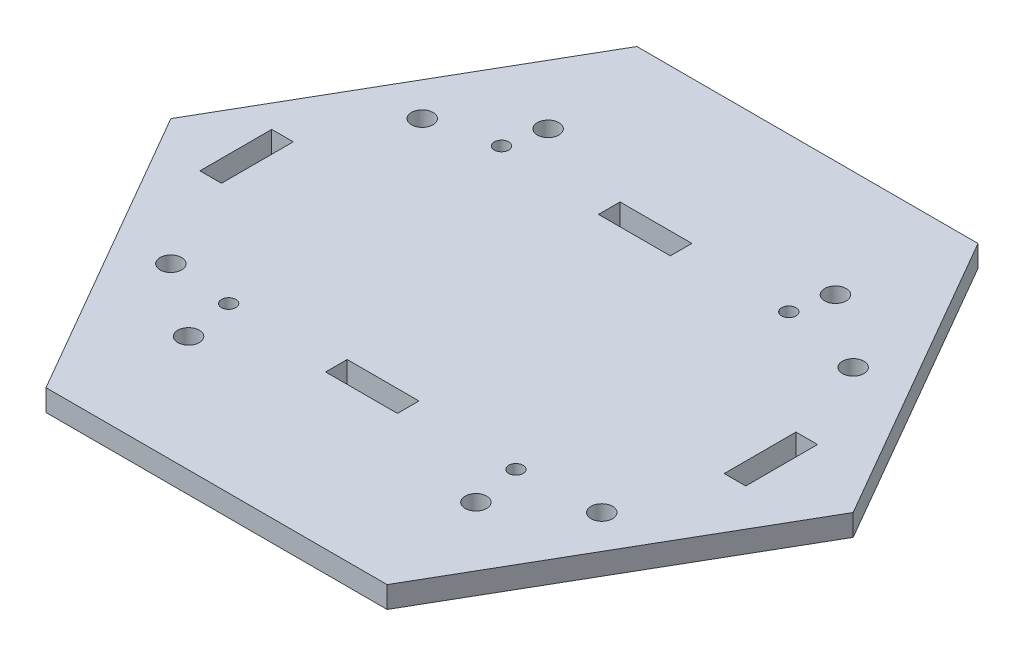
ISO-10303-21;
HEADER;
FILE_DESCRIPTION(('STEP AP214'),'2;1');
FILE_NAME('part.step','',(''),(''),'','','');
FILE_SCHEMA(('AUTOMOTIVE_DESIGN { 1 0 10303 214 1 1 1 1 }'));
ENDSEC;
DATA;
#1=APPLICATION_CONTEXT('core data for automotive mechanical design processes');
#2=APPLICATION_PROTOCOL_DEFINITION('international standard','automotive_design',2000,#1);
#3=PRODUCT_CONTEXT('',#1,'mechanical');
#4=PRODUCT('Part','Part','',(#3));
#5=PRODUCT_RELATED_PRODUCT_CATEGORY('part','',(#4));
#6=PRODUCT_DEFINITION_FORMATION('','',#4);
#7=PRODUCT_DEFINITION_CONTEXT('part definition',#1,'design');
#8=PRODUCT_DEFINITION('design','',#6,#7);
#9=PRODUCT_DEFINITION_SHAPE('','',#8);
#10=(LENGTH_UNIT() NAMED_UNIT(*) SI_UNIT(.MILLI.,.METRE.));
#11=(NAMED_UNIT(*) PLANE_ANGLE_UNIT() SI_UNIT($,.RADIAN.));
#12=(NAMED_UNIT(*) SI_UNIT($,.STERADIAN.) SOLID_ANGLE_UNIT());
#13=UNCERTAINTY_MEASURE_WITH_UNIT(LENGTH_MEASURE(1.E-05),#10,'distance_accuracy_value','');
#14=(GEOMETRIC_REPRESENTATION_CONTEXT(3) GLOBAL_UNCERTAINTY_ASSIGNED_CONTEXT((#13)) GLOBAL_UNIT_ASSIGNED_CONTEXT((#10,
#11,#12)) REPRESENTATION_CONTEXT('',''));
#15=CARTESIAN_POINT('',(0.,0.,0.));
#16=DIRECTION('',(0.,0.,1.));
#17=DIRECTION('',(1.,0.,0.));
#18=AXIS2_PLACEMENT_3D('',#15,#16,#17);
#19=CARTESIAN_POINT('',(-23.75,3.,-41.1362066797608));
#20=DIRECTION('',(0.866025403784439,0.,0.5));
#21=DIRECTION('',(0.5,0.,-0.866025403784439));
#22=AXIS2_PLACEMENT_3D('',#19,#20,#21);
#23=PLANE('',#22);
#24=DIRECTION('',(-0.5,0.,0.866025403784439));
#25=VECTOR('',#24,1.);
#26=CARTESIAN_POINT('',(-23.75,0.,-41.1362066797608));
#27=LINE('',#26,#25);
#28=CARTESIAN_POINT('',(-23.75,0.,-41.1362066797608));
#29=VERTEX_POINT('',#28);
#30=CARTESIAN_POINT('',(-47.5,0.,0.));
#31=VERTEX_POINT('',#30);
#32=EDGE_CURVE('E329',#29,#31,#27,.T.);
#33=ORIENTED_EDGE('',*,*,#32,.T.);
#34=DIRECTION('',(0.,-1.,0.));
#35=VECTOR('',#34,1.);
#36=CARTESIAN_POINT('',(-47.5,3.,0.));
#37=LINE('',#36,#35);
#38=CARTESIAN_POINT('',(-47.5,3.,0.));
#39=VERTEX_POINT('',#38);
#40=EDGE_CURVE('E11',#39,#31,#37,.T.);
#41=ORIENTED_EDGE('',*,*,#40,.F.);
#42=DIRECTION('',(-0.5,0.,0.866025403784439));
#43=VECTOR('',#42,1.);
#44=CARTESIAN_POINT('',(-23.75,3.,-41.1362066797608));
#45=LINE('',#44,#43);
#46=CARTESIAN_POINT('',(-23.75,3.,-41.1362066797608));
#47=VERTEX_POINT('',#46);
#48=EDGE_CURVE('E332',#47,#39,#45,.T.);
#49=ORIENTED_EDGE('',*,*,#48,.F.);
#50=DIRECTION('',(0.,-1.,0.));
#51=VECTOR('',#50,1.);
#52=CARTESIAN_POINT('',(-23.75,3.,-41.1362066797608));
#53=LINE('',#52,#51);
#54=EDGE_CURVE('E346',#47,#29,#53,.T.);
#55=ORIENTED_EDGE('',*,*,#54,.T.);
#56=EDGE_LOOP('',(#33,#41,#49,#55));
#57=FACE_BOUND('',#56,.T.);
#58=ADVANCED_FACE('F40',(#57),#23,.F.);
#59=CARTESIAN_POINT('',(-47.5,3.,0.));
#60=DIRECTION('',(0.866025403784438,0.,-0.5));
#61=DIRECTION('',(-0.5,0.,-0.866025403784439));
#62=AXIS2_PLACEMENT_3D('',#59,#60,#61);
#63=PLANE('',#62);
#64=DIRECTION('',(0.5,0.,0.866025403784439));
#65=VECTOR('',#64,1.);
#66=CARTESIAN_POINT('',(-47.5,0.,0.));
#67=LINE('',#66,#65);
#68=CARTESIAN_POINT('',(-23.75,0.,41.1362066797608));
#69=VERTEX_POINT('',#68);
#70=EDGE_CURVE('E349',#31,#69,#67,.T.);
#71=ORIENTED_EDGE('',*,*,#70,.T.);
#72=DIRECTION('',(0.,-1.,0.));
#73=VECTOR('',#72,1.);
#74=CARTESIAN_POINT('',(-23.75,3.,41.1362066797608));
#75=LINE('',#74,#73);
#76=CARTESIAN_POINT('',(-23.75,3.,41.1362066797608));
#77=VERTEX_POINT('',#76);
#78=EDGE_CURVE('E47',#77,#69,#75,.T.);
#79=ORIENTED_EDGE('',*,*,#78,.F.);
#80=DIRECTION('',(0.5,0.,0.866025403784439));
#81=VECTOR('',#80,1.);
#82=CARTESIAN_POINT('',(-47.5,3.,0.));
#83=LINE('',#82,#81);
#84=EDGE_CURVE('E335',#39,#77,#83,.T.);
#85=ORIENTED_EDGE('',*,*,#84,.F.);
#86=ORIENTED_EDGE('',*,*,#40,.T.);
#87=EDGE_LOOP('',(#71,#79,#85,#86));
#88=FACE_BOUND('',#87,.T.);
#89=ADVANCED_FACE('F395',(#88),#63,.F.);
#90=CARTESIAN_POINT('',(-23.75,3.,41.1362066797608));
#91=DIRECTION('',(0.,0.,-1.));
#92=DIRECTION('',(-1.,0.,0.));
#93=AXIS2_PLACEMENT_3D('',#90,#91,#92);
#94=PLANE('',#93);
#95=DIRECTION('',(1.,0.,0.));
#96=VECTOR('',#95,1.);
#97=CARTESIAN_POINT('',(-23.75,0.,41.1362066797608));
#98=LINE('',#97,#96);
#99=CARTESIAN_POINT('',(23.75,0.,41.1362066797608));
#100=VERTEX_POINT('',#99);
#101=EDGE_CURVE('E351',#69,#100,#98,.T.);
#102=ORIENTED_EDGE('',*,*,#101,.T.);
#103=DIRECTION('',(0.,-1.,0.));
#104=VECTOR('',#103,1.);
#105=CARTESIAN_POINT('',(23.75,3.,41.1362066797608));
#106=LINE('',#105,#104);
#107=CARTESIAN_POINT('',(23.75,3.,41.1362066797608));
#108=VERTEX_POINT('',#107);
#109=EDGE_CURVE('E366',#108,#100,#106,.T.);
#110=ORIENTED_EDGE('',*,*,#109,.F.);
#111=DIRECTION('',(1.,0.,0.));
#112=VECTOR('',#111,1.);
#113=CARTESIAN_POINT('',(-23.75,3.,41.1362066797608));
#114=LINE('',#113,#112);
#115=EDGE_CURVE('E338',#77,#108,#114,.T.);
#116=ORIENTED_EDGE('',*,*,#115,.F.);
#117=ORIENTED_EDGE('',*,*,#78,.T.);
#118=EDGE_LOOP('',(#102,#110,#116,#117));
#119=FACE_BOUND('',#118,.T.);
#120=ADVANCED_FACE('F373',(#119),#94,.F.);
#121=CARTESIAN_POINT('',(23.75,3.,41.1362066797608));
#122=DIRECTION('',(-0.866025403784439,0.,-0.5));
#123=DIRECTION('',(-0.5,0.,0.866025403784439));
#124=AXIS2_PLACEMENT_3D('',#121,#122,#123);
#125=PLANE('',#124);
#126=DIRECTION('',(0.5,0.,-0.866025403784439));
#127=VECTOR('',#126,1.);
#128=CARTESIAN_POINT('',(23.75,0.,41.1362066797608));
#129=LINE('',#128,#127);
#130=CARTESIAN_POINT('',(47.5,0.,0.));
#131=VERTEX_POINT('',#130);
#132=EDGE_CURVE('E353',#100,#131,#129,.T.);
#133=ORIENTED_EDGE('',*,*,#132,.T.);
#134=DIRECTION('',(0.,-1.,0.));
#135=VECTOR('',#134,1.);
#136=CARTESIAN_POINT('',(47.5,3.,0.));
#137=LINE('',#136,#135);
#138=CARTESIAN_POINT('',(47.5,3.,0.));
#139=VERTEX_POINT('',#138);
#140=EDGE_CURVE('E363',#139,#131,#137,.T.);
#141=ORIENTED_EDGE('',*,*,#140,.F.);
#142=DIRECTION('',(0.5,0.,-0.866025403784439));
#143=VECTOR('',#142,1.);
#144=CARTESIAN_POINT('',(23.75,3.,41.1362066797608));
#145=LINE('',#144,#143);
#146=EDGE_CURVE('E340',#108,#139,#145,.T.);
#147=ORIENTED_EDGE('',*,*,#146,.F.);
#148=ORIENTED_EDGE('',*,*,#109,.T.);
#149=EDGE_LOOP('',(#133,#141,#147,#148));
#150=FACE_BOUND('',#149,.T.);
#151=ADVANCED_FACE('F383',(#150),#125,.F.);
#152=CARTESIAN_POINT('',(47.5,3.,0.));
#153=DIRECTION('',(-0.866025403784438,0.,0.5));
#154=DIRECTION('',(0.5,0.,0.866025403784439));
#155=AXIS2_PLACEMENT_3D('',#152,#153,#154);
#156=PLANE('',#155);
#157=DIRECTION('',(-0.5,0.,-0.866025403784439));
#158=VECTOR('',#157,1.);
#159=CARTESIAN_POINT('',(47.5,0.,0.));
#160=LINE('',#159,#158);
#161=CARTESIAN_POINT('',(23.75,0.,-41.1362066797608));
#162=VERTEX_POINT('',#161);
#163=EDGE_CURVE('E355',#131,#162,#160,.T.);
#164=ORIENTED_EDGE('',*,*,#163,.T.);
#165=DIRECTION('',(0.,-1.,0.));
#166=VECTOR('',#165,1.);
#167=CARTESIAN_POINT('',(23.75,3.,-41.1362066797608));
#168=LINE('',#167,#166);
#169=CARTESIAN_POINT('',(23.75,3.,-41.1362066797608));
#170=VERTEX_POINT('',#169);
#171=EDGE_CURVE('E360',#170,#162,#168,.T.);
#172=ORIENTED_EDGE('',*,*,#171,.F.);
#173=DIRECTION('',(-0.5,0.,-0.866025403784439));
#174=VECTOR('',#173,1.);
#175=CARTESIAN_POINT('',(47.5,3.,0.));
#176=LINE('',#175,#174);
#177=EDGE_CURVE('E342',#139,#170,#176,.T.);
#178=ORIENTED_EDGE('',*,*,#177,.F.);
#179=ORIENTED_EDGE('',*,*,#140,.T.);
#180=EDGE_LOOP('',(#164,#172,#178,#179));
#181=FACE_BOUND('',#180,.T.);
#182=ADVANCED_FACE('F387',(#181),#156,.F.);
#183=CARTESIAN_POINT('',(23.75,3.,-41.1362066797608));
#184=DIRECTION('',(0.,0.,1.));
#185=DIRECTION('',(1.,0.,0.));
#186=AXIS2_PLACEMENT_3D('',#183,#184,#185);
#187=PLANE('',#186);
#188=DIRECTION('',(-1.,0.,0.));
#189=VECTOR('',#188,1.);
#190=CARTESIAN_POINT('',(23.75,0.,-41.1362066797608));
#191=LINE('',#190,#189);
#192=EDGE_CURVE('E336',#162,#29,#191,.T.);
#193=ORIENTED_EDGE('',*,*,#192,.T.);
#194=ORIENTED_EDGE('',*,*,#54,.F.);
#195=DIRECTION('',(-1.,0.,0.));
#196=VECTOR('',#195,1.);
#197=CARTESIAN_POINT('',(23.75,3.,-41.1362066797608));
#198=LINE('',#197,#196);
#199=EDGE_CURVE('E344',#170,#47,#198,.T.);
#200=ORIENTED_EDGE('',*,*,#199,.F.);
#201=ORIENTED_EDGE('',*,*,#171,.T.);
#202=EDGE_LOOP('',(#193,#194,#200,#201));
#203=FACE_BOUND('',#202,.T.);
#204=ADVANCED_FACE('F398',(#203),#187,.F.);
#205=CARTESIAN_POINT('',(0.,3.,0.));
#206=DIRECTION('',(0.,1.,0.));
#207=DIRECTION('',(0.,0.,1.));
#208=AXIS2_PLACEMENT_3D('',#205,#206,#207);
#209=PLANE('',#208);
#210=CARTESIAN_POINT('',(-30.,3.,-17.5));
#211=DIRECTION('',(0.,1.,0.));
#212=DIRECTION('',(0.,0.,1.));
#213=AXIS2_PLACEMENT_3D('',#210,#211,#212);
#214=CIRCLE('',#213,1.5);
#215=CARTESIAN_POINT('',(-30.,3.,-16.));
#216=VERTEX_POINT('',#215);
#217=EDGE_CURVE('E726',#216,#216,#214,.T.);
#218=ORIENTED_EDGE('',*,*,#217,.F.);
#219=EDGE_LOOP('',(#218));
#220=FACE_BOUND('',#219,.T.);
#221=CARTESIAN_POINT('',(-30.,3.,17.5));
#222=DIRECTION('',(0.,1.,0.));
#223=DIRECTION('',(0.,0.,1.));
#224=AXIS2_PLACEMENT_3D('',#221,#222,#223);
#225=CIRCLE('',#224,1.5);
#226=CARTESIAN_POINT('',(-30.,3.,19.));
#227=VERTEX_POINT('',#226);
#228=EDGE_CURVE('E728',#227,#227,#225,.T.);
#229=ORIENTED_EDGE('',*,*,#228,.F.);
#230=EDGE_LOOP('',(#229));
#231=FACE_BOUND('',#230,.T.);
#232=CARTESIAN_POINT('',(30.,3.,17.5));
#233=DIRECTION('',(0.,1.,0.));
#234=DIRECTION('',(0.,0.,1.));
#235=AXIS2_PLACEMENT_3D('',#232,#233,#234);
#236=CIRCLE('',#235,1.50000000000001);
#237=CARTESIAN_POINT('',(30.,3.,19.));
#238=VERTEX_POINT('',#237);
#239=EDGE_CURVE('E850',#238,#238,#236,.T.);
#240=ORIENTED_EDGE('',*,*,#239,.F.);
#241=EDGE_LOOP('',(#240));
#242=FACE_BOUND('',#241,.T.);
#243=CARTESIAN_POINT('',(30.,3.,-17.5));
#244=DIRECTION('',(0.,1.,0.));
#245=DIRECTION('',(0.,0.,1.));
#246=AXIS2_PLACEMENT_3D('',#243,#244,#245);
#247=CIRCLE('',#246,1.50000000000001);
#248=CARTESIAN_POINT('',(30.,3.,-16.));
#249=VERTEX_POINT('',#248);
#250=EDGE_CURVE('E736',#249,#249,#247,.T.);
#251=ORIENTED_EDGE('',*,*,#250,.F.);
#252=EDGE_LOOP('',(#251));
#253=FACE_BOUND('',#252,.T.);
#254=CARTESIAN_POINT('',(-20.005,3.,25.03));
#255=DIRECTION('',(0.,1.,0.));
#256=DIRECTION('',(0.,0.,1.));
#257=AXIS2_PLACEMENT_3D('',#254,#255,#256);
#258=CIRCLE('',#257,1.5);
#259=CARTESIAN_POINT('',(-20.005,3.,26.53));
#260=VERTEX_POINT('',#259);
#261=EDGE_CURVE('E735',#260,#260,#258,.T.);
#262=ORIENTED_EDGE('',*,*,#261,.F.);
#263=EDGE_LOOP('',(#262));
#264=FACE_BOUND('',#263,.T.);
#265=CARTESIAN_POINT('',(-20.005,3.,-25.03));
#266=DIRECTION('',(0.,1.,0.));
#267=DIRECTION('',(0.,0.,1.));
#268=AXIS2_PLACEMENT_3D('',#265,#266,#267);
#269=CIRCLE('',#268,1.5);
#270=CARTESIAN_POINT('',(-20.005,3.,-23.53));
#271=VERTEX_POINT('',#270);
#272=EDGE_CURVE('E750',#271,#271,#269,.T.);
#273=ORIENTED_EDGE('',*,*,#272,.F.);
#274=EDGE_LOOP('',(#273));
#275=FACE_BOUND('',#274,.T.);
#276=CARTESIAN_POINT('',(20.005,3.,-25.03));
#277=DIRECTION('',(0.,1.,0.));
#278=DIRECTION('',(0.,0.,1.));
#279=AXIS2_PLACEMENT_3D('',#276,#277,#278);
#280=CIRCLE('',#279,1.50000000000001);
#281=CARTESIAN_POINT('',(20.005,3.,-23.53));
#282=VERTEX_POINT('',#281);
#283=EDGE_CURVE('E744',#282,#282,#280,.T.);
#284=ORIENTED_EDGE('',*,*,#283,.F.);
#285=EDGE_LOOP('',(#284));
#286=FACE_BOUND('',#285,.T.);
#287=CARTESIAN_POINT('',(20.005,3.,25.03));
#288=DIRECTION('',(0.,1.,0.));
#289=DIRECTION('',(0.,0.,1.));
#290=AXIS2_PLACEMENT_3D('',#287,#288,#289);
#291=CIRCLE('',#290,1.50000000000001);
#292=CARTESIAN_POINT('',(20.005,3.,26.53));
#293=VERTEX_POINT('',#292);
#294=EDGE_CURVE('E743',#293,#293,#291,.T.);
#295=ORIENTED_EDGE('',*,*,#294,.F.);
#296=EDGE_LOOP('',(#295));
#297=FACE_BOUND('',#296,.T.);
#298=DIRECTION('',(-1.,0.,0.));
#299=VECTOR('',#298,1.);
#300=CARTESIAN_POINT('',(-36.1776197623355,3.,-5.72345666125401));
#301=LINE('',#300,#299);
#302=CARTESIAN_POINT('',(-36.1776197623355,3.,-5.72345666125401));
#303=VERTEX_POINT('',#302);
#304=CARTESIAN_POINT('',(-39.1776197623355,3.,-5.72345666125401));
#305=VERTEX_POINT('',#304);
#306=EDGE_CURVE('E54',#303,#305,#301,.T.);
#307=ORIENTED_EDGE('',*,*,#306,.F.);
#308=DIRECTION('',(0.,0.,-1.));
#309=VECTOR('',#308,1.);
#310=CARTESIAN_POINT('',(-36.1776197623355,3.,-5.72345666125401));
#311=LINE('',#310,#309);
#312=CARTESIAN_POINT('',(-36.1776197623355,3.,4.27654333874599));
#313=VERTEX_POINT('',#312);
#314=EDGE_CURVE('E236',#313,#303,#311,.T.);
#315=ORIENTED_EDGE('',*,*,#314,.F.);
#316=DIRECTION('',(1.,0.,0.));
#317=VECTOR('',#316,1.);
#318=CARTESIAN_POINT('',(-39.1776197623355,3.,4.27654333874599));
#319=LINE('',#318,#317);
#320=CARTESIAN_POINT('',(-39.1776197623355,3.,4.27654333874599));
#321=VERTEX_POINT('',#320);
#322=EDGE_CURVE('E251',#321,#313,#319,.T.);
#323=ORIENTED_EDGE('',*,*,#322,.F.);
#324=DIRECTION('',(0.,0.,1.));
#325=VECTOR('',#324,1.);
#326=CARTESIAN_POINT('',(-39.1776197623355,3.,-5.72345666125401));
#327=LINE('',#326,#325);
#328=EDGE_CURVE('E247',#305,#321,#327,.T.);
#329=ORIENTED_EDGE('',*,*,#328,.F.);
#330=EDGE_LOOP('',(#307,#315,#323,#329));
#331=FACE_BOUND('',#330,.T.);
#332=DIRECTION('',(0.,0.,1.));
#333=VECTOR('',#332,1.);
#334=CARTESIAN_POINT('',(-6.17761976233546,3.,16.776543338746));
#335=LINE('',#334,#333);
#336=CARTESIAN_POINT('',(-6.17761976233546,3.,16.776543338746));
#337=VERTEX_POINT('',#336);
#338=CARTESIAN_POINT('',(-6.17761976233546,3.,19.776543338746));
#339=VERTEX_POINT('',#338);
#340=EDGE_CURVE('E62',#337,#339,#335,.T.);
#341=ORIENTED_EDGE('',*,*,#340,.F.);
#342=DIRECTION('',(-1.,0.,0.));
#343=VECTOR('',#342,1.);
#344=CARTESIAN_POINT('',(3.82238023766454,3.,16.776543338746));
#345=LINE('',#344,#343);
#346=CARTESIAN_POINT('',(3.82238023766454,3.,16.776543338746));
#347=VERTEX_POINT('',#346);
#348=EDGE_CURVE('E209',#347,#337,#345,.T.);
#349=ORIENTED_EDGE('',*,*,#348,.F.);
#350=DIRECTION('',(0.,0.,-1.));
#351=VECTOR('',#350,1.);
#352=CARTESIAN_POINT('',(3.82238023766454,3.,19.776543338746));
#353=LINE('',#352,#351);
#354=CARTESIAN_POINT('',(3.82238023766454,3.,19.776543338746));
#355=VERTEX_POINT('',#354);
#356=EDGE_CURVE('E212',#355,#347,#353,.T.);
#357=ORIENTED_EDGE('',*,*,#356,.F.);
#358=DIRECTION('',(1.,0.,0.));
#359=VECTOR('',#358,1.);
#360=CARTESIAN_POINT('',(-6.17761976233546,3.,19.776543338746));
#361=LINE('',#360,#359);
#362=EDGE_CURVE('E221',#339,#355,#361,.T.);
#363=ORIENTED_EDGE('',*,*,#362,.F.);
#364=EDGE_LOOP('',(#341,#349,#357,#363));
#365=FACE_BOUND('',#364,.T.);
#366=DIRECTION('',(-1.,0.,0.));
#367=VECTOR('',#366,1.);
#368=CARTESIAN_POINT('',(33.8223802376645,3.,-5.72345666125402));
#369=LINE('',#368,#367);
#370=CARTESIAN_POINT('',(36.8223802376645,3.,-5.72345666125402));
#371=VERTEX_POINT('',#370);
#372=CARTESIAN_POINT('',(33.8223802376645,3.,-5.72345666125402));
#373=VERTEX_POINT('',#372);
#374=EDGE_CURVE('E228',#371,#373,#369,.T.);
#375=ORIENTED_EDGE('',*,*,#374,.F.);
#376=DIRECTION('',(0.,0.,-1.));
#377=VECTOR('',#376,1.);
#378=CARTESIAN_POINT('',(36.8223802376645,3.,-5.72345666125402));
#379=LINE('',#378,#377);
#380=CARTESIAN_POINT('',(36.8223802376645,3.,4.27654333874598));
#381=VERTEX_POINT('',#380);
#382=EDGE_CURVE('E300',#381,#371,#379,.T.);
#383=ORIENTED_EDGE('',*,*,#382,.F.);
#384=DIRECTION('',(1.,0.,0.));
#385=VECTOR('',#384,1.);
#386=CARTESIAN_POINT('',(36.8223802376645,3.,4.27654333874598));
#387=LINE('',#386,#385);
#388=CARTESIAN_POINT('',(33.8223802376645,3.,4.27654333874598));
#389=VERTEX_POINT('',#388);
#390=EDGE_CURVE('E314',#389,#381,#387,.T.);
#391=ORIENTED_EDGE('',*,*,#390,.F.);
#392=DIRECTION('',(0.,0.,1.));
#393=VECTOR('',#392,1.);
#394=CARTESIAN_POINT('',(33.8223802376645,3.,-5.72345666125402));
#395=LINE('',#394,#393);
#396=EDGE_CURVE('E311',#373,#389,#395,.T.);
#397=ORIENTED_EDGE('',*,*,#396,.F.);
#398=EDGE_LOOP('',(#375,#383,#391,#397));
#399=FACE_BOUND('',#398,.T.);
#400=DIRECTION('',(1.,0.,0.));
#401=VECTOR('',#400,1.);
#402=CARTESIAN_POINT('',(3.82238023766454,3.,-18.223456661254));
#403=LINE('',#402,#401);
#404=CARTESIAN_POINT('',(-6.17761976233546,3.,-18.223456661254));
#405=VERTEX_POINT('',#404);
#406=CARTESIAN_POINT('',(3.82238023766454,3.,-18.223456661254));
#407=VERTEX_POINT('',#406);
#408=EDGE_CURVE('E276',#405,#407,#403,.T.);
#409=ORIENTED_EDGE('',*,*,#408,.F.);
#410=DIRECTION('',(0.,0.,1.));
#411=VECTOR('',#410,1.);
#412=CARTESIAN_POINT('',(-6.17761976233546,3.,-18.223456661254));
#413=LINE('',#412,#411);
#414=CARTESIAN_POINT('',(-6.17761976233546,3.,-21.223456661254));
#415=VERTEX_POINT('',#414);
#416=EDGE_CURVE('E266',#415,#405,#413,.T.);
#417=ORIENTED_EDGE('',*,*,#416,.F.);
#418=DIRECTION('',(-1.,0.,0.));
#419=VECTOR('',#418,1.);
#420=CARTESIAN_POINT('',(-6.17761976233546,3.,-21.223456661254));
#421=LINE('',#420,#419);
#422=CARTESIAN_POINT('',(3.82238023766454,3.,-21.223456661254));
#423=VERTEX_POINT('',#422);
#424=EDGE_CURVE('E282',#423,#415,#421,.T.);
#425=ORIENTED_EDGE('',*,*,#424,.F.);
#426=DIRECTION('',(0.,0.,-1.));
#427=VECTOR('',#426,1.);
#428=CARTESIAN_POINT('',(3.82238023766454,3.,-21.223456661254));
#429=LINE('',#428,#427);
#430=EDGE_CURVE('E278',#407,#423,#429,.T.);
#431=ORIENTED_EDGE('',*,*,#430,.F.);
#432=EDGE_LOOP('',(#409,#417,#425,#431));
#433=FACE_BOUND('',#432,.T.);
#434=CARTESIAN_POINT('',(18.8223802376646,3.,-19.723456661254));
#435=DIRECTION('',(0.,1.,0.));
#436=DIRECTION('',(0.,0.,-1.));
#437=AXIS2_PLACEMENT_3D('',#434,#435,#436);
#438=CIRCLE('',#437,1.);
#439=CARTESIAN_POINT('',(18.8223802376646,3.,-20.723456661254));
#440=VERTEX_POINT('',#439);
#441=EDGE_CURVE('E765',#440,#440,#438,.T.);
#442=ORIENTED_EDGE('',*,*,#441,.F.);
#443=EDGE_LOOP('',(#442));
#444=FACE_BOUND('',#443,.T.);
#445=CARTESIAN_POINT('',(18.8223802376646,3.,18.276543338746));
#446=DIRECTION('',(0.,1.,0.));
#447=DIRECTION('',(0.,0.,1.));
#448=AXIS2_PLACEMENT_3D('',#445,#446,#447);
#449=CIRCLE('',#448,1.);
#450=CARTESIAN_POINT('',(18.8223802376646,3.,19.276543338746));
#451=VERTEX_POINT('',#450);
#452=EDGE_CURVE('E771',#451,#451,#449,.T.);
#453=ORIENTED_EDGE('',*,*,#452,.F.);
#454=EDGE_LOOP('',(#453));
#455=FACE_BOUND('',#454,.T.);
#456=CARTESIAN_POINT('',(-21.1776197623355,3.,18.276543338746));
#457=DIRECTION('',(0.,1.,0.));
#458=DIRECTION('',(0.,0.,-1.));
#459=AXIS2_PLACEMENT_3D('',#456,#457,#458);
#460=CIRCLE('',#459,1.);
#461=CARTESIAN_POINT('',(-21.1776197623355,3.,17.276543338746));
#462=VERTEX_POINT('',#461);
#463=EDGE_CURVE('E215',#462,#462,#460,.T.);
#464=ORIENTED_EDGE('',*,*,#463,.F.);
#465=EDGE_LOOP('',(#464));
#466=FACE_BOUND('',#465,.T.);
#467=CARTESIAN_POINT('',(-21.1776197623355,3.,-19.723456661254));
#468=DIRECTION('',(0.,1.,0.));
#469=DIRECTION('',(0.,0.,1.));
#470=AXIS2_PLACEMENT_3D('',#467,#468,#469);
#471=CIRCLE('',#470,1.);
#472=CARTESIAN_POINT('',(-21.1776197623355,3.,-18.723456661254));
#473=VERTEX_POINT('',#472);
#474=EDGE_CURVE('E289',#473,#473,#471,.T.);
#475=ORIENTED_EDGE('',*,*,#474,.F.);
#476=EDGE_LOOP('',(#475));
#477=FACE_BOUND('',#476,.T.);
#478=ORIENTED_EDGE('',*,*,#48,.T.);
#479=ORIENTED_EDGE('',*,*,#84,.T.);
#480=ORIENTED_EDGE('',*,*,#115,.T.);
#481=ORIENTED_EDGE('',*,*,#146,.T.);
#482=ORIENTED_EDGE('',*,*,#177,.T.);
#483=ORIENTED_EDGE('',*,*,#199,.T.);
#484=EDGE_LOOP('',(#478,#479,#480,#481,#482,#483));
#485=FACE_BOUND('',#484,.T.);
#486=ADVANCED_FACE('F391',(#220,#231,#242,#253,#264,#275,#286,#297,#331,#365,#399,#433,#444,
#455,#466,#477,#485),#209,.T.);
#487=CARTESIAN_POINT('',(0.,0.,0.));
#488=DIRECTION('',(0.,1.,0.));
#489=DIRECTION('',(0.,0.,1.));
#490=AXIS2_PLACEMENT_3D('',#487,#488,#489);
#491=PLANE('',#490);
#492=CARTESIAN_POINT('',(-30.,0.,-17.5));
#493=DIRECTION('',(0.,1.,0.));
#494=DIRECTION('',(0.,0.,1.));
#495=AXIS2_PLACEMENT_3D('',#492,#493,#494);
#496=CIRCLE('',#495,1.5);
#497=CARTESIAN_POINT('',(-30.,0.,-16.));
#498=VERTEX_POINT('',#497);
#499=EDGE_CURVE('E723',#498,#498,#496,.T.);
#500=ORIENTED_EDGE('',*,*,#499,.T.);
#501=EDGE_LOOP('',(#500));
#502=FACE_BOUND('',#501,.T.);
#503=CARTESIAN_POINT('',(-30.,0.,17.5));
#504=DIRECTION('',(0.,1.,0.));
#505=DIRECTION('',(0.,0.,1.));
#506=AXIS2_PLACEMENT_3D('',#503,#504,#505);
#507=CIRCLE('',#506,1.5);
#508=CARTESIAN_POINT('',(-30.,0.,19.));
#509=VERTEX_POINT('',#508);
#510=EDGE_CURVE('E855',#509,#509,#507,.T.);
#511=ORIENTED_EDGE('',*,*,#510,.T.);
#512=EDGE_LOOP('',(#511));
#513=FACE_BOUND('',#512,.T.);
#514=CARTESIAN_POINT('',(30.,0.,17.5));
#515=DIRECTION('',(0.,1.,0.));
#516=DIRECTION('',(0.,0.,1.));
#517=AXIS2_PLACEMENT_3D('',#514,#515,#516);
#518=CIRCLE('',#517,1.50000000000001);
#519=CARTESIAN_POINT('',(30.,0.,19.));
#520=VERTEX_POINT('',#519);
#521=EDGE_CURVE('E739',#520,#520,#518,.T.);
#522=ORIENTED_EDGE('',*,*,#521,.T.);
#523=EDGE_LOOP('',(#522));
#524=FACE_BOUND('',#523,.T.);
#525=CARTESIAN_POINT('',(30.,0.,-17.5));
#526=DIRECTION('',(0.,1.,0.));
#527=DIRECTION('',(0.,0.,1.));
#528=AXIS2_PLACEMENT_3D('',#525,#526,#527);
#529=CIRCLE('',#528,1.50000000000001);
#530=CARTESIAN_POINT('',(30.,0.,-16.));
#531=VERTEX_POINT('',#530);
#532=EDGE_CURVE('E732',#531,#531,#529,.T.);
#533=ORIENTED_EDGE('',*,*,#532,.T.);
#534=EDGE_LOOP('',(#533));
#535=FACE_BOUND('',#534,.T.);
#536=CARTESIAN_POINT('',(-20.005,0.,25.03));
#537=DIRECTION('',(0.,1.,0.));
#538=DIRECTION('',(0.,0.,1.));
#539=AXIS2_PLACEMENT_3D('',#536,#537,#538);
#540=CIRCLE('',#539,1.5);
#541=CARTESIAN_POINT('',(-20.005,0.,26.53));
#542=VERTEX_POINT('',#541);
#543=EDGE_CURVE('E753',#542,#542,#540,.T.);
#544=ORIENTED_EDGE('',*,*,#543,.T.);
#545=EDGE_LOOP('',(#544));
#546=FACE_BOUND('',#545,.T.);
#547=CARTESIAN_POINT('',(-20.005,0.,-25.03));
#548=DIRECTION('',(0.,1.,0.));
#549=DIRECTION('',(0.,0.,1.));
#550=AXIS2_PLACEMENT_3D('',#547,#548,#549);
#551=CIRCLE('',#550,1.5);
#552=CARTESIAN_POINT('',(-20.005,0.,-23.53));
#553=VERTEX_POINT('',#552);
#554=EDGE_CURVE('E747',#553,#553,#551,.T.);
#555=ORIENTED_EDGE('',*,*,#554,.T.);
#556=EDGE_LOOP('',(#555));
#557=FACE_BOUND('',#556,.T.);
#558=CARTESIAN_POINT('',(20.005,0.,-25.03));
#559=DIRECTION('',(0.,1.,0.));
#560=DIRECTION('',(0.,0.,1.));
#561=AXIS2_PLACEMENT_3D('',#558,#559,#560);
#562=CIRCLE('',#561,1.50000000000001);
#563=CARTESIAN_POINT('',(20.005,0.,-23.53));
#564=VERTEX_POINT('',#563);
#565=EDGE_CURVE('E740',#564,#564,#562,.T.);
#566=ORIENTED_EDGE('',*,*,#565,.T.);
#567=EDGE_LOOP('',(#566));
#568=FACE_BOUND('',#567,.T.);
#569=CARTESIAN_POINT('',(20.005,0.,25.03));
#570=DIRECTION('',(0.,1.,0.));
#571=DIRECTION('',(0.,0.,1.));
#572=AXIS2_PLACEMENT_3D('',#569,#570,#571);
#573=CIRCLE('',#572,1.50000000000001);
#574=CARTESIAN_POINT('',(20.005,0.,26.53));
#575=VERTEX_POINT('',#574);
#576=EDGE_CURVE('E758',#575,#575,#573,.T.);
#577=ORIENTED_EDGE('',*,*,#576,.T.);
#578=EDGE_LOOP('',(#577));
#579=FACE_BOUND('',#578,.T.);
#580=DIRECTION('',(0.,0.,-1.));
#581=VECTOR('',#580,1.);
#582=CARTESIAN_POINT('',(-36.1776197623355,0.,-5.72345666125401));
#583=LINE('',#582,#581);
#584=CARTESIAN_POINT('',(-36.1776197623355,0.,4.27654333874599));
#585=VERTEX_POINT('',#584);
#586=CARTESIAN_POINT('',(-36.1776197623355,0.,-5.72345666125401));
#587=VERTEX_POINT('',#586);
#588=EDGE_CURVE('E242',#585,#587,#583,.T.);
#589=ORIENTED_EDGE('',*,*,#588,.T.);
#590=DIRECTION('',(-1.,0.,0.));
#591=VECTOR('',#590,1.);
#592=CARTESIAN_POINT('',(-36.1776197623355,0.,-5.72345666125401));
#593=LINE('',#592,#591);
#594=CARTESIAN_POINT('',(-39.1776197623355,0.,-5.72345666125401));
#595=VERTEX_POINT('',#594);
#596=EDGE_CURVE('E232',#587,#595,#593,.T.);
#597=ORIENTED_EDGE('',*,*,#596,.T.);
#598=DIRECTION('',(0.,0.,1.));
#599=VECTOR('',#598,1.);
#600=CARTESIAN_POINT('',(-39.1776197623355,0.,-5.72345666125401));
#601=LINE('',#600,#599);
#602=CARTESIAN_POINT('',(-39.1776197623355,0.,4.27654333874599));
#603=VERTEX_POINT('',#602);
#604=EDGE_CURVE('E235',#595,#603,#601,.T.);
#605=ORIENTED_EDGE('',*,*,#604,.T.);
#606=DIRECTION('',(1.,0.,0.));
#607=VECTOR('',#606,1.);
#608=CARTESIAN_POINT('',(-39.1776197623355,0.,4.27654333874599));
#609=LINE('',#608,#607);
#610=EDGE_CURVE('E239',#603,#585,#609,.T.);
#611=ORIENTED_EDGE('',*,*,#610,.T.);
#612=EDGE_LOOP('',(#589,#597,#605,#611));
#613=FACE_BOUND('',#612,.T.);
#614=DIRECTION('',(-1.,0.,0.));
#615=VECTOR('',#614,1.);
#616=CARTESIAN_POINT('',(3.82238023766454,0.,16.776543338746));
#617=LINE('',#616,#615);
#618=CARTESIAN_POINT('',(3.82238023766454,0.,16.776543338746));
#619=VERTEX_POINT('',#618);
#620=CARTESIAN_POINT('',(-6.17761976233546,0.,16.776543338746));
#621=VERTEX_POINT('',#620);
#622=EDGE_CURVE('E196',#619,#621,#617,.T.);
#623=ORIENTED_EDGE('',*,*,#622,.T.);
#624=DIRECTION('',(0.,0.,1.));
#625=VECTOR('',#624,1.);
#626=CARTESIAN_POINT('',(-6.17761976233546,0.,16.776543338746));
#627=LINE('',#626,#625);
#628=CARTESIAN_POINT('',(-6.17761976233546,0.,19.776543338746));
#629=VERTEX_POINT('',#628);
#630=EDGE_CURVE('E190',#621,#629,#627,.T.);
#631=ORIENTED_EDGE('',*,*,#630,.T.);
#632=DIRECTION('',(1.,0.,0.));
#633=VECTOR('',#632,1.);
#634=CARTESIAN_POINT('',(-6.17761976233546,0.,19.776543338746));
#635=LINE('',#634,#633);
#636=CARTESIAN_POINT('',(3.82238023766454,0.,19.776543338746));
#637=VERTEX_POINT('',#636);
#638=EDGE_CURVE('E200',#629,#637,#635,.T.);
#639=ORIENTED_EDGE('',*,*,#638,.T.);
#640=DIRECTION('',(0.,0.,-1.));
#641=VECTOR('',#640,1.);
#642=CARTESIAN_POINT('',(3.82238023766454,0.,19.776543338746));
#643=LINE('',#642,#641);
#644=EDGE_CURVE('E204',#637,#619,#643,.T.);
#645=ORIENTED_EDGE('',*,*,#644,.T.);
#646=EDGE_LOOP('',(#623,#631,#639,#645));
#647=FACE_BOUND('',#646,.T.);
#648=DIRECTION('',(0.,0.,-1.));
#649=VECTOR('',#648,1.);
#650=CARTESIAN_POINT('',(36.8223802376645,0.,-5.72345666125402));
#651=LINE('',#650,#649);
#652=CARTESIAN_POINT('',(36.8223802376645,0.,4.27654333874598));
#653=VERTEX_POINT('',#652);
#654=CARTESIAN_POINT('',(36.8223802376645,0.,-5.72345666125402));
#655=VERTEX_POINT('',#654);
#656=EDGE_CURVE('E306',#653,#655,#651,.T.);
#657=ORIENTED_EDGE('',*,*,#656,.T.);
#658=DIRECTION('',(-1.,0.,0.));
#659=VECTOR('',#658,1.);
#660=CARTESIAN_POINT('',(33.8223802376645,0.,-5.72345666125402));
#661=LINE('',#660,#659);
#662=CARTESIAN_POINT('',(33.8223802376645,0.,-5.72345666125402));
#663=VERTEX_POINT('',#662);
#664=EDGE_CURVE('E296',#655,#663,#661,.T.);
#665=ORIENTED_EDGE('',*,*,#664,.T.);
#666=DIRECTION('',(0.,0.,1.));
#667=VECTOR('',#666,1.);
#668=CARTESIAN_POINT('',(33.8223802376645,0.,-5.72345666125402));
#669=LINE('',#668,#667);
#670=CARTESIAN_POINT('',(33.8223802376645,0.,4.27654333874598));
#671=VERTEX_POINT('',#670);
#672=EDGE_CURVE('E299',#663,#671,#669,.T.);
#673=ORIENTED_EDGE('',*,*,#672,.T.);
#674=DIRECTION('',(1.,0.,0.));
#675=VECTOR('',#674,1.);
#676=CARTESIAN_POINT('',(36.8223802376645,0.,4.27654333874598));
#677=LINE('',#676,#675);
#678=EDGE_CURVE('E303',#671,#653,#677,.T.);
#679=ORIENTED_EDGE('',*,*,#678,.T.);
#680=EDGE_LOOP('',(#657,#665,#673,#679));
#681=FACE_BOUND('',#680,.T.);
#682=DIRECTION('',(0.,0.,1.));
#683=VECTOR('',#682,1.);
#684=CARTESIAN_POINT('',(-6.17761976233546,0.,-18.223456661254));
#685=LINE('',#684,#683);
#686=CARTESIAN_POINT('',(-6.17761976233546,0.,-21.223456661254));
#687=VERTEX_POINT('',#686);
#688=CARTESIAN_POINT('',(-6.17761976233546,0.,-18.223456661254));
#689=VERTEX_POINT('',#688);
#690=EDGE_CURVE('E272',#687,#689,#685,.T.);
#691=ORIENTED_EDGE('',*,*,#690,.T.);
#692=DIRECTION('',(1.,0.,0.));
#693=VECTOR('',#692,1.);
#694=CARTESIAN_POINT('',(3.82238023766454,0.,-18.223456661254));
#695=LINE('',#694,#693);
#696=CARTESIAN_POINT('',(3.82238023766454,0.,-18.223456661254));
#697=VERTEX_POINT('',#696);
#698=EDGE_CURVE('E262',#689,#697,#695,.T.);
#699=ORIENTED_EDGE('',*,*,#698,.T.);
#700=DIRECTION('',(0.,0.,-1.));
#701=VECTOR('',#700,1.);
#702=CARTESIAN_POINT('',(3.82238023766454,0.,-21.223456661254));
#703=LINE('',#702,#701);
#704=CARTESIAN_POINT('',(3.82238023766454,0.,-21.223456661254));
#705=VERTEX_POINT('',#704);
#706=EDGE_CURVE('E265',#697,#705,#703,.T.);
#707=ORIENTED_EDGE('',*,*,#706,.T.);
#708=DIRECTION('',(-1.,0.,0.));
#709=VECTOR('',#708,1.);
#710=CARTESIAN_POINT('',(-6.17761976233546,0.,-21.223456661254));
#711=LINE('',#710,#709);
#712=EDGE_CURVE('E269',#705,#687,#711,.T.);
#713=ORIENTED_EDGE('',*,*,#712,.T.);
#714=EDGE_LOOP('',(#691,#699,#707,#713));
#715=FACE_BOUND('',#714,.T.);
#716=CARTESIAN_POINT('',(18.8223802376646,0.,-19.723456661254));
#717=DIRECTION('',(0.,1.,0.));
#718=DIRECTION('',(0.,0.,-1.));
#719=AXIS2_PLACEMENT_3D('',#716,#717,#718);
#720=CIRCLE('',#719,1.);
#721=CARTESIAN_POINT('',(18.8223802376646,0.,-20.723456661254));
#722=VERTEX_POINT('',#721);
#723=EDGE_CURVE('E248',#722,#722,#720,.T.);
#724=ORIENTED_EDGE('',*,*,#723,.T.);
#725=EDGE_LOOP('',(#724));
#726=FACE_BOUND('',#725,.T.);
#727=CARTESIAN_POINT('',(18.8223802376646,0.,18.276543338746));
#728=DIRECTION('',(0.,1.,0.));
#729=DIRECTION('',(0.,0.,1.));
#730=AXIS2_PLACEMENT_3D('',#727,#728,#729);
#731=CIRCLE('',#730,1.);
#732=CARTESIAN_POINT('',(18.8223802376646,0.,19.276543338746));
#733=VERTEX_POINT('',#732);
#734=EDGE_CURVE('E768',#733,#733,#731,.T.);
#735=ORIENTED_EDGE('',*,*,#734,.T.);
#736=EDGE_LOOP('',(#735));
#737=FACE_BOUND('',#736,.T.);
#738=CARTESIAN_POINT('',(-21.1776197623355,0.,18.276543338746));
#739=DIRECTION('',(0.,1.,0.));
#740=DIRECTION('',(0.,0.,-1.));
#741=AXIS2_PLACEMENT_3D('',#738,#739,#740);
#742=CIRCLE('',#741,1.);
#743=CARTESIAN_POINT('',(-21.1776197623355,0.,17.276543338746));
#744=VERTEX_POINT('',#743);
#745=EDGE_CURVE('E773',#744,#744,#742,.T.);
#746=ORIENTED_EDGE('',*,*,#745,.T.);
#747=EDGE_LOOP('',(#746));
#748=FACE_BOUND('',#747,.T.);
#749=CARTESIAN_POINT('',(-21.1776197623355,0.,-19.723456661254));
#750=DIRECTION('',(0.,1.,0.));
#751=DIRECTION('',(0.,0.,1.));
#752=AXIS2_PLACEMENT_3D('',#749,#750,#751);
#753=CIRCLE('',#752,1.);
#754=CARTESIAN_POINT('',(-21.1776197623355,0.,-18.723456661254));
#755=VERTEX_POINT('',#754);
#756=EDGE_CURVE('E326',#755,#755,#753,.T.);
#757=ORIENTED_EDGE('',*,*,#756,.T.);
#758=EDGE_LOOP('',(#757));
#759=FACE_BOUND('',#758,.T.);
#760=ORIENTED_EDGE('',*,*,#32,.F.);
#761=ORIENTED_EDGE('',*,*,#192,.F.);
#762=ORIENTED_EDGE('',*,*,#163,.F.);
#763=ORIENTED_EDGE('',*,*,#132,.F.);
#764=ORIENTED_EDGE('',*,*,#101,.F.);
#765=ORIENTED_EDGE('',*,*,#70,.F.);
#766=EDGE_LOOP('',(#760,#761,#762,#763,#764,#765));
#767=FACE_BOUND('',#766,.T.);
#768=ADVANCED_FACE('F206',(#502,#513,#524,#535,#546,#557,#568,#579,#613,#647,#681,#715,#726,
#737,#748,#759,#767),#491,.F.);
#769=CARTESIAN_POINT('',(-21.1776197623355,0.,-19.723456661254));
#770=DIRECTION('',(0.,1.,0.));
#771=DIRECTION('',(0.,0.,1.));
#772=AXIS2_PLACEMENT_3D('',#769,#770,#771);
#773=CYLINDRICAL_SURFACE('',#772,1.);
#774=ORIENTED_EDGE('',*,*,#756,.F.);
#775=EDGE_LOOP('',(#774));
#776=FACE_BOUND('',#775,.T.);
#777=ORIENTED_EDGE('',*,*,#474,.T.);
#778=EDGE_LOOP('',(#777));
#779=FACE_BOUND('',#778,.T.);
#780=ADVANCED_FACE('F438',(#776,#779),#773,.F.);
#781=CARTESIAN_POINT('',(-21.1776197623355,0.,18.276543338746));
#782=DIRECTION('',(0.,1.,0.));
#783=DIRECTION('',(0.,0.,1.));
#784=AXIS2_PLACEMENT_3D('',#781,#782,#783);
#785=CYLINDRICAL_SURFACE('',#784,1.);
#786=ORIENTED_EDGE('',*,*,#745,.F.);
#787=EDGE_LOOP('',(#786));
#788=FACE_BOUND('',#787,.T.);
#789=ORIENTED_EDGE('',*,*,#463,.T.);
#790=EDGE_LOOP('',(#789));
#791=FACE_BOUND('',#790,.T.);
#792=ADVANCED_FACE('F443',(#788,#791),#785,.F.);
#793=CARTESIAN_POINT('',(18.8223802376646,0.,18.276543338746));
#794=DIRECTION('',(0.,1.,0.));
#795=DIRECTION('',(0.,0.,1.));
#796=AXIS2_PLACEMENT_3D('',#793,#794,#795);
#797=CYLINDRICAL_SURFACE('',#796,1.);
#798=ORIENTED_EDGE('',*,*,#734,.F.);
#799=EDGE_LOOP('',(#798));
#800=FACE_BOUND('',#799,.T.);
#801=ORIENTED_EDGE('',*,*,#452,.T.);
#802=EDGE_LOOP('',(#801));
#803=FACE_BOUND('',#802,.T.);
#804=ADVANCED_FACE('F455',(#800,#803),#797,.F.);
#805=CARTESIAN_POINT('',(18.8223802376646,0.,-19.723456661254));
#806=DIRECTION('',(0.,1.,0.));
#807=DIRECTION('',(0.,0.,1.));
#808=AXIS2_PLACEMENT_3D('',#805,#806,#807);
#809=CYLINDRICAL_SURFACE('',#808,1.);
#810=ORIENTED_EDGE('',*,*,#723,.F.);
#811=EDGE_LOOP('',(#810));
#812=FACE_BOUND('',#811,.T.);
#813=ORIENTED_EDGE('',*,*,#441,.T.);
#814=EDGE_LOOP('',(#813));
#815=FACE_BOUND('',#814,.T.);
#816=ADVANCED_FACE('F465',(#812,#815),#809,.F.);
#817=CARTESIAN_POINT('',(3.82238023766454,0.,-18.223456661254));
#818=DIRECTION('',(0.,0.,1.));
#819=DIRECTION('',(1.,0.,0.));
#820=AXIS2_PLACEMENT_3D('',#817,#818,#819);
#821=PLANE('',#820);
#822=ORIENTED_EDGE('',*,*,#408,.T.);
#823=DIRECTION('',(0.,1.,0.));
#824=VECTOR('',#823,1.);
#825=CARTESIAN_POINT('',(3.82238023766454,0.,-18.223456661254));
#826=LINE('',#825,#824);
#827=EDGE_CURVE('E275',#697,#407,#826,.T.);
#828=ORIENTED_EDGE('',*,*,#827,.F.);
#829=ORIENTED_EDGE('',*,*,#698,.F.);
#830=DIRECTION('',(0.,1.,0.));
#831=VECTOR('',#830,1.);
#832=CARTESIAN_POINT('',(-6.17761976233546,0.,-18.223456661254));
#833=LINE('',#832,#831);
#834=EDGE_CURVE('E287',#689,#405,#833,.T.);
#835=ORIENTED_EDGE('',*,*,#834,.T.);
#836=EDGE_LOOP('',(#822,#828,#829,#835));
#837=FACE_BOUND('',#836,.T.);
#838=ADVANCED_FACE('F475',(#837),#821,.F.);
#839=CARTESIAN_POINT('',(-6.17761976233546,0.,-18.223456661254));
#840=DIRECTION('',(-1.,0.,0.));
#841=DIRECTION('',(0.,0.,1.));
#842=AXIS2_PLACEMENT_3D('',#839,#840,#841);
#843=PLANE('',#842);
#844=ORIENTED_EDGE('',*,*,#416,.T.);
#845=ORIENTED_EDGE('',*,*,#834,.F.);
#846=ORIENTED_EDGE('',*,*,#690,.F.);
#847=DIRECTION('',(0.,1.,0.));
#848=VECTOR('',#847,1.);
#849=CARTESIAN_POINT('',(-6.17761976233546,0.,-21.223456661254));
#850=LINE('',#849,#848);
#851=EDGE_CURVE('E290',#687,#415,#850,.T.);
#852=ORIENTED_EDGE('',*,*,#851,.T.);
#853=EDGE_LOOP('',(#844,#845,#846,#852));
#854=FACE_BOUND('',#853,.T.);
#855=ADVANCED_FACE('F485',(#854),#843,.F.);
#856=CARTESIAN_POINT('',(-6.17761976233546,0.,-21.223456661254));
#857=DIRECTION('',(0.,0.,-1.));
#858=DIRECTION('',(-1.,0.,0.));
#859=AXIS2_PLACEMENT_3D('',#856,#857,#858);
#860=PLANE('',#859);
#861=ORIENTED_EDGE('',*,*,#424,.T.);
#862=ORIENTED_EDGE('',*,*,#851,.F.);
#863=ORIENTED_EDGE('',*,*,#712,.F.);
#864=DIRECTION('',(0.,1.,0.));
#865=VECTOR('',#864,1.);
#866=CARTESIAN_POINT('',(3.82238023766454,0.,-21.223456661254));
#867=LINE('',#866,#865);
#868=EDGE_CURVE('E292',#705,#423,#867,.T.);
#869=ORIENTED_EDGE('',*,*,#868,.T.);
#870=EDGE_LOOP('',(#861,#862,#863,#869));
#871=FACE_BOUND('',#870,.T.);
#872=ADVANCED_FACE('F495',(#871),#860,.F.);
#873=CARTESIAN_POINT('',(3.82238023766454,0.,-21.223456661254));
#874=DIRECTION('',(1.,0.,0.));
#875=DIRECTION('',(0.,0.,-1.));
#876=AXIS2_PLACEMENT_3D('',#873,#874,#875);
#877=PLANE('',#876);
#878=ORIENTED_EDGE('',*,*,#430,.T.);
#879=ORIENTED_EDGE('',*,*,#868,.F.);
#880=ORIENTED_EDGE('',*,*,#706,.F.);
#881=ORIENTED_EDGE('',*,*,#827,.T.);
#882=EDGE_LOOP('',(#878,#879,#880,#881));
#883=FACE_BOUND('',#882,.T.);
#884=ADVANCED_FACE('F505',(#883),#877,.F.);
#885=CARTESIAN_POINT('',(33.8223802376645,0.,-5.72345666125402));
#886=DIRECTION('',(0.,0.,-1.));
#887=DIRECTION('',(-1.,0.,0.));
#888=AXIS2_PLACEMENT_3D('',#885,#886,#887);
#889=PLANE('',#888);
#890=ORIENTED_EDGE('',*,*,#374,.T.);
#891=DIRECTION('',(0.,1.,0.));
#892=VECTOR('',#891,1.);
#893=CARTESIAN_POINT('',(33.8223802376645,0.,-5.72345666125402));
#894=LINE('',#893,#892);
#895=EDGE_CURVE('E309',#663,#373,#894,.T.);
#896=ORIENTED_EDGE('',*,*,#895,.F.);
#897=ORIENTED_EDGE('',*,*,#664,.F.);
#898=DIRECTION('',(0.,1.,0.));
#899=VECTOR('',#898,1.);
#900=CARTESIAN_POINT('',(36.8223802376645,0.,-5.72345666125402));
#901=LINE('',#900,#899);
#902=EDGE_CURVE('E279',#655,#371,#901,.T.);
#903=ORIENTED_EDGE('',*,*,#902,.T.);
#904=EDGE_LOOP('',(#890,#896,#897,#903));
#905=FACE_BOUND('',#904,.T.);
#906=ADVANCED_FACE('F515',(#905),#889,.F.);
#907=CARTESIAN_POINT('',(36.8223802376645,0.,-5.72345666125402));
#908=DIRECTION('',(1.,0.,0.));
#909=DIRECTION('',(0.,0.,-1.));
#910=AXIS2_PLACEMENT_3D('',#907,#908,#909);
#911=PLANE('',#910);
#912=ORIENTED_EDGE('',*,*,#382,.T.);
#913=ORIENTED_EDGE('',*,*,#902,.F.);
#914=ORIENTED_EDGE('',*,*,#656,.F.);
#915=DIRECTION('',(0.,1.,0.));
#916=VECTOR('',#915,1.);
#917=CARTESIAN_POINT('',(36.8223802376645,0.,4.27654333874598));
#918=LINE('',#917,#916);
#919=EDGE_CURVE('E320',#653,#381,#918,.T.);
#920=ORIENTED_EDGE('',*,*,#919,.T.);
#921=EDGE_LOOP('',(#912,#913,#914,#920));
#922=FACE_BOUND('',#921,.T.);
#923=ADVANCED_FACE('F525',(#922),#911,.F.);
#924=CARTESIAN_POINT('',(36.8223802376645,0.,4.27654333874598));
#925=DIRECTION('',(0.,0.,1.));
#926=DIRECTION('',(1.,0.,0.));
#927=AXIS2_PLACEMENT_3D('',#924,#925,#926);
#928=PLANE('',#927);
#929=ORIENTED_EDGE('',*,*,#390,.T.);
#930=ORIENTED_EDGE('',*,*,#919,.F.);
#931=ORIENTED_EDGE('',*,*,#678,.F.);
#932=DIRECTION('',(0.,1.,0.));
#933=VECTOR('',#932,1.);
#934=CARTESIAN_POINT('',(33.8223802376645,0.,4.27654333874598));
#935=LINE('',#934,#933);
#936=EDGE_CURVE('E322',#671,#389,#935,.T.);
#937=ORIENTED_EDGE('',*,*,#936,.T.);
#938=EDGE_LOOP('',(#929,#930,#931,#937));
#939=FACE_BOUND('',#938,.T.);
#940=ADVANCED_FACE('F535',(#939),#928,.F.);
#941=CARTESIAN_POINT('',(33.8223802376645,0.,-5.72345666125402));
#942=DIRECTION('',(-1.,0.,0.));
#943=DIRECTION('',(0.,0.,1.));
#944=AXIS2_PLACEMENT_3D('',#941,#942,#943);
#945=PLANE('',#944);
#946=ORIENTED_EDGE('',*,*,#396,.T.);
#947=ORIENTED_EDGE('',*,*,#936,.F.);
#948=ORIENTED_EDGE('',*,*,#672,.F.);
#949=ORIENTED_EDGE('',*,*,#895,.T.);
#950=EDGE_LOOP('',(#946,#947,#948,#949));
#951=FACE_BOUND('',#950,.T.);
#952=ADVANCED_FACE('F545',(#951),#945,.F.);
#953=CARTESIAN_POINT('',(-6.17761976233546,0.,16.776543338746));
#954=DIRECTION('',(-1.,0.,0.));
#955=DIRECTION('',(0.,0.,1.));
#956=AXIS2_PLACEMENT_3D('',#953,#954,#955);
#957=PLANE('',#956);
#958=ORIENTED_EDGE('',*,*,#340,.T.);
#959=DIRECTION('',(0.,1.,0.));
#960=VECTOR('',#959,1.);
#961=CARTESIAN_POINT('',(-6.17761976233546,0.,19.776543338746));
#962=LINE('',#961,#960);
#963=EDGE_CURVE('E186',#629,#339,#962,.T.);
#964=ORIENTED_EDGE('',*,*,#963,.F.);
#965=ORIENTED_EDGE('',*,*,#630,.F.);
#966=DIRECTION('',(0.,1.,0.));
#967=VECTOR('',#966,1.);
#968=CARTESIAN_POINT('',(-6.17761976233546,0.,16.776543338746));
#969=LINE('',#968,#967);
#970=EDGE_CURVE('E226',#621,#337,#969,.T.);
#971=ORIENTED_EDGE('',*,*,#970,.T.);
#972=EDGE_LOOP('',(#958,#964,#965,#971));
#973=FACE_BOUND('',#972,.T.);
#974=ADVANCED_FACE('F188',(#973),#957,.F.);
#975=CARTESIAN_POINT('',(3.82238023766454,0.,16.776543338746));
#976=DIRECTION('',(0.,0.,-1.));
#977=DIRECTION('',(-1.,0.,0.));
#978=AXIS2_PLACEMENT_3D('',#975,#976,#977);
#979=PLANE('',#978);
#980=ORIENTED_EDGE('',*,*,#348,.T.);
#981=ORIENTED_EDGE('',*,*,#970,.F.);
#982=ORIENTED_EDGE('',*,*,#622,.F.);
#983=DIRECTION('',(0.,1.,0.));
#984=VECTOR('',#983,1.);
#985=CARTESIAN_POINT('',(3.82238023766454,0.,16.776543338746));
#986=LINE('',#985,#984);
#987=EDGE_CURVE('E229',#619,#347,#986,.T.);
#988=ORIENTED_EDGE('',*,*,#987,.T.);
#989=EDGE_LOOP('',(#980,#981,#982,#988));
#990=FACE_BOUND('',#989,.T.);
#991=ADVANCED_FACE('F564',(#990),#979,.F.);
#992=CARTESIAN_POINT('',(3.82238023766454,0.,19.776543338746));
#993=DIRECTION('',(1.,0.,0.));
#994=DIRECTION('',(0.,0.,-1.));
#995=AXIS2_PLACEMENT_3D('',#992,#993,#994);
#996=PLANE('',#995);
#997=ORIENTED_EDGE('',*,*,#356,.T.);
#998=ORIENTED_EDGE('',*,*,#987,.F.);
#999=ORIENTED_EDGE('',*,*,#644,.F.);
#1000=DIRECTION('',(0.,1.,0.));
#1001=VECTOR('',#1000,1.);
#1002=CARTESIAN_POINT('',(3.82238023766454,0.,19.776543338746));
#1003=LINE('',#1002,#1001);
#1004=EDGE_CURVE('E195',#637,#355,#1003,.T.);
#1005=ORIENTED_EDGE('',*,*,#1004,.T.);
#1006=EDGE_LOOP('',(#997,#998,#999,#1005));
#1007=FACE_BOUND('',#1006,.T.);
#1008=ADVANCED_FACE('F573',(#1007),#996,.F.);
#1009=CARTESIAN_POINT('',(-6.17761976233546,0.,19.776543338746));
#1010=DIRECTION('',(0.,0.,1.));
#1011=DIRECTION('',(1.,0.,0.));
#1012=AXIS2_PLACEMENT_3D('',#1009,#1010,#1011);
#1013=PLANE('',#1012);
#1014=ORIENTED_EDGE('',*,*,#362,.T.);
#1015=ORIENTED_EDGE('',*,*,#1004,.F.);
#1016=ORIENTED_EDGE('',*,*,#638,.F.);
#1017=ORIENTED_EDGE('',*,*,#963,.T.);
#1018=EDGE_LOOP('',(#1014,#1015,#1016,#1017));
#1019=FACE_BOUND('',#1018,.T.);
#1020=ADVANCED_FACE('F201',(#1019),#1013,.F.);
#1021=CARTESIAN_POINT('',(-36.1776197623355,0.,-5.72345666125401));
#1022=DIRECTION('',(0.,0.,-1.));
#1023=DIRECTION('',(-1.,0.,0.));
#1024=AXIS2_PLACEMENT_3D('',#1021,#1022,#1023);
#1025=PLANE('',#1024);
#1026=ORIENTED_EDGE('',*,*,#306,.T.);
#1027=DIRECTION('',(0.,1.,0.));
#1028=VECTOR('',#1027,1.);
#1029=CARTESIAN_POINT('',(-39.1776197623355,0.,-5.72345666125401));
#1030=LINE('',#1029,#1028);
#1031=EDGE_CURVE('E245',#595,#305,#1030,.T.);
#1032=ORIENTED_EDGE('',*,*,#1031,.F.);
#1033=ORIENTED_EDGE('',*,*,#596,.F.);
#1034=DIRECTION('',(0.,1.,0.));
#1035=VECTOR('',#1034,1.);
#1036=CARTESIAN_POINT('',(-36.1776197623355,0.,-5.72345666125401));
#1037=LINE('',#1036,#1035);
#1038=EDGE_CURVE('E222',#587,#303,#1037,.T.);
#1039=ORIENTED_EDGE('',*,*,#1038,.T.);
#1040=EDGE_LOOP('',(#1026,#1032,#1033,#1039));
#1041=FACE_BOUND('',#1040,.T.);
#1042=ADVANCED_FACE('F592',(#1041),#1025,.F.);
#1043=CARTESIAN_POINT('',(-36.1776197623355,0.,-5.72345666125401));
#1044=DIRECTION('',(1.,0.,0.));
#1045=DIRECTION('',(0.,0.,-1.));
#1046=AXIS2_PLACEMENT_3D('',#1043,#1044,#1045);
#1047=PLANE('',#1046);
#1048=ORIENTED_EDGE('',*,*,#314,.T.);
#1049=ORIENTED_EDGE('',*,*,#1038,.F.);
#1050=ORIENTED_EDGE('',*,*,#588,.F.);
#1051=DIRECTION('',(0.,1.,0.));
#1052=VECTOR('',#1051,1.);
#1053=CARTESIAN_POINT('',(-36.1776197623355,0.,4.27654333874599));
#1054=LINE('',#1053,#1052);
#1055=EDGE_CURVE('E257',#585,#313,#1054,.T.);
#1056=ORIENTED_EDGE('',*,*,#1055,.T.);
#1057=EDGE_LOOP('',(#1048,#1049,#1050,#1056));
#1058=FACE_BOUND('',#1057,.T.);
#1059=ADVANCED_FACE('F601',(#1058),#1047,.F.);
#1060=CARTESIAN_POINT('',(-39.1776197623355,0.,4.27654333874599));
#1061=DIRECTION('',(0.,0.,1.));
#1062=DIRECTION('',(1.,0.,0.));
#1063=AXIS2_PLACEMENT_3D('',#1060,#1061,#1062);
#1064=PLANE('',#1063);
#1065=ORIENTED_EDGE('',*,*,#322,.T.);
#1066=ORIENTED_EDGE('',*,*,#1055,.F.);
#1067=ORIENTED_EDGE('',*,*,#610,.F.);
#1068=DIRECTION('',(0.,1.,0.));
#1069=VECTOR('',#1068,1.);
#1070=CARTESIAN_POINT('',(-39.1776197623355,0.,4.27654333874599));
#1071=LINE('',#1070,#1069);
#1072=EDGE_CURVE('E259',#603,#321,#1071,.T.);
#1073=ORIENTED_EDGE('',*,*,#1072,.T.);
#1074=EDGE_LOOP('',(#1065,#1066,#1067,#1073));
#1075=FACE_BOUND('',#1074,.T.);
#1076=ADVANCED_FACE('F610',(#1075),#1064,.F.);
#1077=CARTESIAN_POINT('',(-39.1776197623355,0.,-5.72345666125401));
#1078=DIRECTION('',(-1.,0.,0.));
#1079=DIRECTION('',(0.,0.,1.));
#1080=AXIS2_PLACEMENT_3D('',#1077,#1078,#1079);
#1081=PLANE('',#1080);
#1082=ORIENTED_EDGE('',*,*,#328,.T.);
#1083=ORIENTED_EDGE('',*,*,#1072,.F.);
#1084=ORIENTED_EDGE('',*,*,#604,.F.);
#1085=ORIENTED_EDGE('',*,*,#1031,.T.);
#1086=EDGE_LOOP('',(#1082,#1083,#1084,#1085));
#1087=FACE_BOUND('',#1086,.T.);
#1088=ADVANCED_FACE('F620',(#1087),#1081,.F.);
#1089=CARTESIAN_POINT('',(20.005,0.,25.03));
#1090=DIRECTION('',(0.,1.,0.));
#1091=DIRECTION('',(0.,0.,1.));
#1092=AXIS2_PLACEMENT_3D('',#1089,#1090,#1091);
#1093=CYLINDRICAL_SURFACE('',#1092,1.50000000000001);
#1094=ORIENTED_EDGE('',*,*,#576,.F.);
#1095=EDGE_LOOP('',(#1094));
#1096=FACE_BOUND('',#1095,.T.);
#1097=ORIENTED_EDGE('',*,*,#294,.T.);
#1098=EDGE_LOOP('',(#1097));
#1099=FACE_BOUND('',#1098,.T.);
#1100=ADVANCED_FACE('F630',(#1096,#1099),#1093,.F.);
#1101=CARTESIAN_POINT('',(20.005,0.,-25.03));
#1102=DIRECTION('',(0.,1.,0.));
#1103=DIRECTION('',(0.,0.,1.));
#1104=AXIS2_PLACEMENT_3D('',#1101,#1102,#1103);
#1105=CYLINDRICAL_SURFACE('',#1104,1.50000000000001);
#1106=ORIENTED_EDGE('',*,*,#565,.F.);
#1107=EDGE_LOOP('',(#1106));
#1108=FACE_BOUND('',#1107,.T.);
#1109=ORIENTED_EDGE('',*,*,#283,.T.);
#1110=EDGE_LOOP('',(#1109));
#1111=FACE_BOUND('',#1110,.T.);
#1112=ADVANCED_FACE('F640',(#1108,#1111),#1105,.F.);
#1113=CARTESIAN_POINT('',(-20.005,0.,-25.03));
#1114=DIRECTION('',(0.,1.,0.));
#1115=DIRECTION('',(0.,0.,1.));
#1116=AXIS2_PLACEMENT_3D('',#1113,#1114,#1115);
#1117=CYLINDRICAL_SURFACE('',#1116,1.5);
#1118=ORIENTED_EDGE('',*,*,#554,.F.);
#1119=EDGE_LOOP('',(#1118));
#1120=FACE_BOUND('',#1119,.T.);
#1121=ORIENTED_EDGE('',*,*,#272,.T.);
#1122=EDGE_LOOP('',(#1121));
#1123=FACE_BOUND('',#1122,.T.);
#1124=ADVANCED_FACE('F650',(#1120,#1123),#1117,.F.);
#1125=CARTESIAN_POINT('',(-20.005,0.,25.03));
#1126=DIRECTION('',(0.,1.,0.));
#1127=DIRECTION('',(0.,0.,1.));
#1128=AXIS2_PLACEMENT_3D('',#1125,#1126,#1127);
#1129=CYLINDRICAL_SURFACE('',#1128,1.5);
#1130=ORIENTED_EDGE('',*,*,#543,.F.);
#1131=EDGE_LOOP('',(#1130));
#1132=FACE_BOUND('',#1131,.T.);
#1133=ORIENTED_EDGE('',*,*,#261,.T.);
#1134=EDGE_LOOP('',(#1133));
#1135=FACE_BOUND('',#1134,.T.);
#1136=ADVANCED_FACE('F660',(#1132,#1135),#1129,.F.);
#1137=CARTESIAN_POINT('',(30.,0.,-17.5));
#1138=DIRECTION('',(0.,1.,0.));
#1139=DIRECTION('',(0.,0.,1.));
#1140=AXIS2_PLACEMENT_3D('',#1137,#1138,#1139);
#1141=CYLINDRICAL_SURFACE('',#1140,1.50000000000001);
#1142=ORIENTED_EDGE('',*,*,#532,.F.);
#1143=EDGE_LOOP('',(#1142));
#1144=FACE_BOUND('',#1143,.T.);
#1145=ORIENTED_EDGE('',*,*,#250,.T.);
#1146=EDGE_LOOP('',(#1145));
#1147=FACE_BOUND('',#1146,.T.);
#1148=ADVANCED_FACE('F669',(#1144,#1147),#1141,.F.);
#1149=CARTESIAN_POINT('',(30.,0.,17.5));
#1150=DIRECTION('',(0.,1.,0.));
#1151=DIRECTION('',(0.,0.,1.));
#1152=AXIS2_PLACEMENT_3D('',#1149,#1150,#1151);
#1153=CYLINDRICAL_SURFACE('',#1152,1.50000000000001);
#1154=ORIENTED_EDGE('',*,*,#521,.F.);
#1155=EDGE_LOOP('',(#1154));
#1156=FACE_BOUND('',#1155,.T.);
#1157=ORIENTED_EDGE('',*,*,#239,.T.);
#1158=EDGE_LOOP('',(#1157));
#1159=FACE_BOUND('',#1158,.T.);
#1160=ADVANCED_FACE('F686',(#1156,#1159),#1153,.F.);
#1161=CARTESIAN_POINT('',(-30.,0.,17.5));
#1162=DIRECTION('',(0.,1.,0.));
#1163=DIRECTION('',(0.,0.,1.));
#1164=AXIS2_PLACEMENT_3D('',#1161,#1162,#1163);
#1165=CYLINDRICAL_SURFACE('',#1164,1.5);
#1166=ORIENTED_EDGE('',*,*,#510,.F.);
#1167=EDGE_LOOP('',(#1166));
#1168=FACE_BOUND('',#1167,.T.);
#1169=ORIENTED_EDGE('',*,*,#228,.T.);
#1170=EDGE_LOOP('',(#1169));
#1171=FACE_BOUND('',#1170,.T.);
#1172=ADVANCED_FACE('F696',(#1168,#1171),#1165,.F.);
#1173=CARTESIAN_POINT('',(-30.,0.,-17.5));
#1174=DIRECTION('',(0.,1.,0.));
#1175=DIRECTION('',(0.,0.,1.));
#1176=AXIS2_PLACEMENT_3D('',#1173,#1174,#1175);
#1177=CYLINDRICAL_SURFACE('',#1176,1.5);
#1178=ORIENTED_EDGE('',*,*,#499,.F.);
#1179=EDGE_LOOP('',(#1178));
#1180=FACE_BOUND('',#1179,.T.);
#1181=ORIENTED_EDGE('',*,*,#217,.T.);
#1182=EDGE_LOOP('',(#1181));
#1183=FACE_BOUND('',#1182,.T.);
#1184=ADVANCED_FACE('F706',(#1180,#1183),#1177,.F.);
#1185=CLOSED_SHELL('',(#58,#89,#120,#151,#182,#204,#486,#768,#780,#792,#804,#816,#838,#855,#872,
#884,#906,#923,#940,#952,#974,#991,#1008,#1020,#1042,#1059,#1076,#1088,#1100,#1112,#1124,#1136,
#1148,#1160,#1172,#1184));
#1186=MANIFOLD_SOLID_BREP('B2',#1185);
#1187=ADVANCED_BREP_SHAPE_REPRESENTATION('',(#18,#1186),#14);
#1188=SHAPE_DEFINITION_REPRESENTATION(#9,#1187);
ENDSEC;
END-ISO-10303-21;
